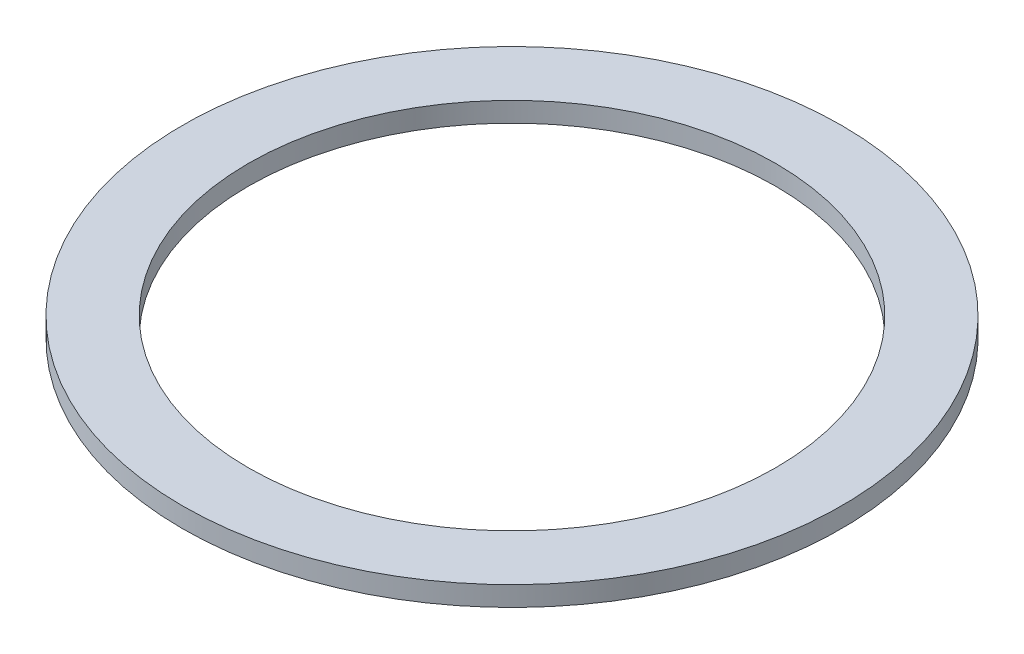
ISO-10303-21;
HEADER;
FILE_DESCRIPTION(('STEP AP214'),'2;1');
FILE_NAME('part.step','',(''),(''),'','','');
FILE_SCHEMA(('AUTOMOTIVE_DESIGN { 1 0 10303 214 1 1 1 1 }'));
ENDSEC;
DATA;
#1=APPLICATION_CONTEXT('core data for automotive mechanical design processes');
#2=APPLICATION_PROTOCOL_DEFINITION('international standard','automotive_design',2000,#1);
#3=PRODUCT_CONTEXT('',#1,'mechanical');
#4=PRODUCT('Part','Part','',(#3));
#5=PRODUCT_RELATED_PRODUCT_CATEGORY('part','',(#4));
#6=PRODUCT_DEFINITION_FORMATION('','',#4);
#7=PRODUCT_DEFINITION_CONTEXT('part definition',#1,'design');
#8=PRODUCT_DEFINITION('design','',#6,#7);
#9=PRODUCT_DEFINITION_SHAPE('','',#8);
#10=(LENGTH_UNIT() NAMED_UNIT(*) SI_UNIT(.MILLI.,.METRE.));
#11=(NAMED_UNIT(*) PLANE_ANGLE_UNIT() SI_UNIT($,.RADIAN.));
#12=(NAMED_UNIT(*) SI_UNIT($,.STERADIAN.) SOLID_ANGLE_UNIT());
#13=UNCERTAINTY_MEASURE_WITH_UNIT(LENGTH_MEASURE(1.E-05),#10,'distance_accuracy_value','');
#14=(GEOMETRIC_REPRESENTATION_CONTEXT(3) GLOBAL_UNCERTAINTY_ASSIGNED_CONTEXT((#13)) GLOBAL_UNIT_ASSIGNED_CONTEXT((#10,
#11,#12)) REPRESENTATION_CONTEXT('',''));
#15=CARTESIAN_POINT('',(0.,0.,0.));
#16=DIRECTION('',(0.,0.,1.));
#17=DIRECTION('',(1.,0.,0.));
#18=AXIS2_PLACEMENT_3D('',#15,#16,#17);
#19=CARTESIAN_POINT('',(0.,30.,0.));
#20=DIRECTION('',(0.,1.,0.));
#21=DIRECTION('',(0.,0.,1.));
#22=AXIS2_PLACEMENT_3D('',#19,#20,#21);
#23=PLANE('',#22);
#24=CARTESIAN_POINT('',(0.,30.,0.));
#25=DIRECTION('',(0.,1.,0.));
#26=DIRECTION('',(0.,0.,1.));
#27=AXIS2_PLACEMENT_3D('',#24,#25,#26);
#28=CIRCLE('',#27,500.);
#29=CARTESIAN_POINT('',(0.,30.,500.));
#30=VERTEX_POINT('',#29);
#31=EDGE_CURVE('E10',#30,#30,#28,.T.);
#32=ORIENTED_EDGE('',*,*,#31,.T.);
#33=EDGE_LOOP('',(#32));
#34=FACE_BOUND('',#33,.T.);
#35=CARTESIAN_POINT('',(0.,30.,0.));
#36=DIRECTION('',(0.,1.,0.));
#37=DIRECTION('',(0.,0.,1.));
#38=AXIS2_PLACEMENT_3D('',#35,#36,#37);
#39=CIRCLE('',#38,400.);
#40=CARTESIAN_POINT('',(0.,30.,400.));
#41=VERTEX_POINT('',#40);
#42=EDGE_CURVE('E42',#41,#41,#39,.T.);
#43=ORIENTED_EDGE('',*,*,#42,.F.);
#44=EDGE_LOOP('',(#43));
#45=FACE_BOUND('',#44,.T.);
#46=ADVANCED_FACE('F31',(#34,#45),#23,.T.);
#47=CARTESIAN_POINT('',(0.,0.,0.));
#48=DIRECTION('',(0.,1.,0.));
#49=DIRECTION('',(0.,0.,1.));
#50=AXIS2_PLACEMENT_3D('',#47,#48,#49);
#51=PLANE('',#50);
#52=CARTESIAN_POINT('',(0.,0.,0.));
#53=DIRECTION('',(0.,1.,0.));
#54=DIRECTION('',(0.,0.,1.));
#55=AXIS2_PLACEMENT_3D('',#52,#53,#54);
#56=CIRCLE('',#55,500.);
#57=CARTESIAN_POINT('',(0.,0.,500.));
#58=VERTEX_POINT('',#57);
#59=EDGE_CURVE('E35',#58,#58,#56,.T.);
#60=ORIENTED_EDGE('',*,*,#59,.F.);
#61=EDGE_LOOP('',(#60));
#62=FACE_BOUND('',#61,.T.);
#63=CARTESIAN_POINT('',(0.,0.,0.));
#64=DIRECTION('',(0.,1.,0.));
#65=DIRECTION('',(0.,0.,1.));
#66=AXIS2_PLACEMENT_3D('',#63,#64,#65);
#67=CIRCLE('',#66,400.);
#68=CARTESIAN_POINT('',(0.,0.,400.));
#69=VERTEX_POINT('',#68);
#70=EDGE_CURVE('E44',#69,#69,#67,.T.);
#71=ORIENTED_EDGE('',*,*,#70,.T.);
#72=EDGE_LOOP('',(#71));
#73=FACE_BOUND('',#72,.T.);
#74=ADVANCED_FACE('F54',(#62,#73),#51,.F.);
#75=CARTESIAN_POINT('',(0.,30.,0.));
#76=DIRECTION('',(0.,-1.,0.));
#77=DIRECTION('',(0.,0.,-1.));
#78=AXIS2_PLACEMENT_3D('',#75,#76,#77);
#79=CYLINDRICAL_SURFACE('',#78,500.);
#80=ORIENTED_EDGE('',*,*,#31,.F.);
#81=EDGE_LOOP('',(#80));
#82=FACE_BOUND('',#81,.T.);
#83=ORIENTED_EDGE('',*,*,#59,.T.);
#84=EDGE_LOOP('',(#83));
#85=FACE_BOUND('',#84,.T.);
#86=ADVANCED_FACE('F33',(#82,#85),#79,.T.);
#87=CARTESIAN_POINT('',(0.,30.,0.));
#88=DIRECTION('',(0.,-1.,0.));
#89=DIRECTION('',(0.,0.,-1.));
#90=AXIS2_PLACEMENT_3D('',#87,#88,#89);
#91=CYLINDRICAL_SURFACE('',#90,400.);
#92=ORIENTED_EDGE('',*,*,#42,.T.);
#93=EDGE_LOOP('',(#92));
#94=FACE_BOUND('',#93,.T.);
#95=ORIENTED_EDGE('',*,*,#70,.F.);
#96=EDGE_LOOP('',(#95));
#97=FACE_BOUND('',#96,.T.);
#98=ADVANCED_FACE('F50',(#94,#97),#91,.F.);
#99=CLOSED_SHELL('',(#46,#74,#86,#98));
#100=MANIFOLD_SOLID_BREP('B2',#99);
#101=ADVANCED_BREP_SHAPE_REPRESENTATION('',(#18,#100),#14);
#102=SHAPE_DEFINITION_REPRESENTATION(#9,#101);
ENDSEC;
END-ISO-10303-21;
